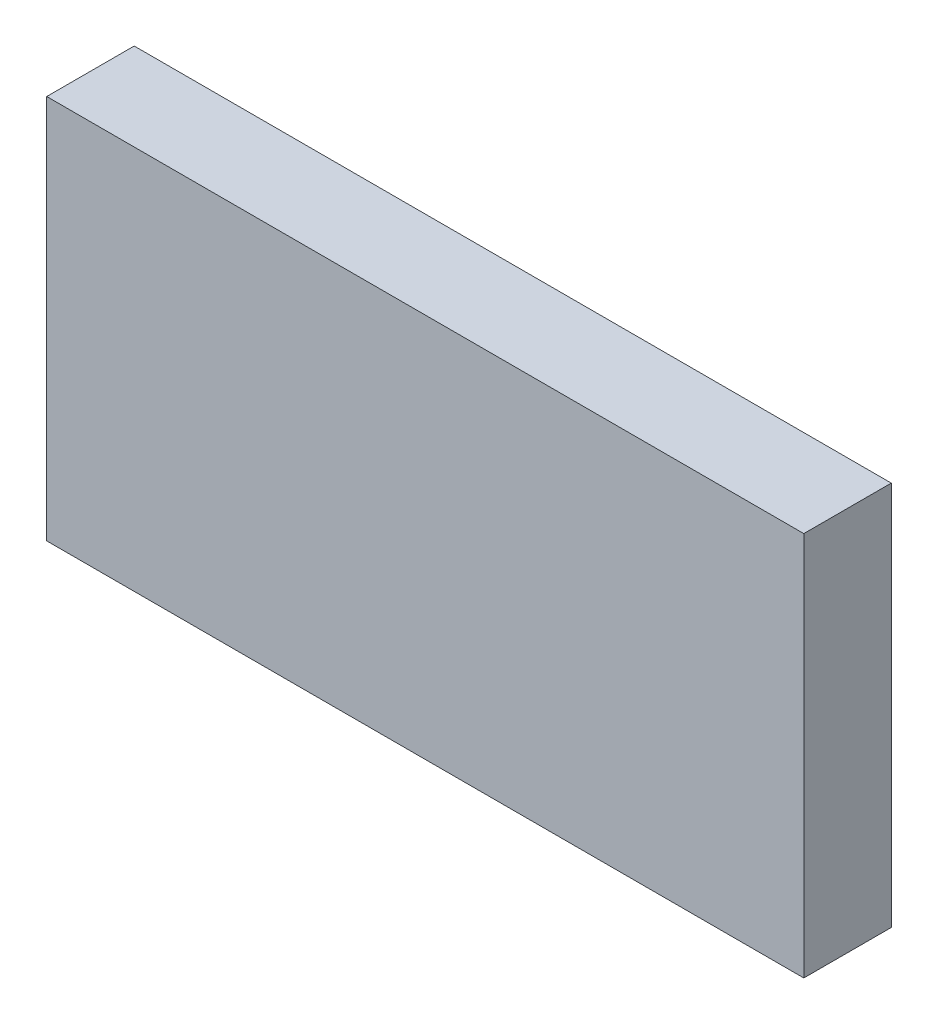
ISO-10303-21;
HEADER;
FILE_DESCRIPTION(('STEP AP214'),'2;1');
FILE_NAME('part.step','',(''),(''),'','','');
FILE_SCHEMA(('AUTOMOTIVE_DESIGN { 1 0 10303 214 1 1 1 1 }'));
ENDSEC;
DATA;
#1=APPLICATION_CONTEXT('core data for automotive mechanical design processes');
#2=APPLICATION_PROTOCOL_DEFINITION('international standard','automotive_design',2000,#1);
#3=PRODUCT_CONTEXT('',#1,'mechanical');
#4=PRODUCT('Part','Part','',(#3));
#5=PRODUCT_RELATED_PRODUCT_CATEGORY('part','',(#4));
#6=PRODUCT_DEFINITION_FORMATION('','',#4);
#7=PRODUCT_DEFINITION_CONTEXT('part definition',#1,'design');
#8=PRODUCT_DEFINITION('design','',#6,#7);
#9=PRODUCT_DEFINITION_SHAPE('','',#8);
#10=(LENGTH_UNIT() NAMED_UNIT(*) SI_UNIT(.MILLI.,.METRE.));
#11=(NAMED_UNIT(*) PLANE_ANGLE_UNIT() SI_UNIT($,.RADIAN.));
#12=(NAMED_UNIT(*) SI_UNIT($,.STERADIAN.) SOLID_ANGLE_UNIT());
#13=UNCERTAINTY_MEASURE_WITH_UNIT(LENGTH_MEASURE(1.E-05),#10,'distance_accuracy_value','');
#14=(GEOMETRIC_REPRESENTATION_CONTEXT(3) GLOBAL_UNCERTAINTY_ASSIGNED_CONTEXT((#13)) GLOBAL_UNIT_ASSIGNED_CONTEXT((#10,
#11,#12)) REPRESENTATION_CONTEXT('',''));
#15=CARTESIAN_POINT('',(0.,0.,0.));
#16=DIRECTION('',(0.,0.,1.));
#17=DIRECTION('',(1.,0.,0.));
#18=AXIS2_PLACEMENT_3D('',#15,#16,#17);
#19=CARTESIAN_POINT('',(0.5795,-2.22,0.));
#20=DIRECTION('',(1.,0.,0.));
#21=DIRECTION('',(0.,0.,1.));
#22=AXIS2_PLACEMENT_3D('',#19,#20,#21);
#23=PLANE('',#22);
#24=DIRECTION('',(0.,1.,0.));
#25=VECTOR('',#24,1.);
#26=CARTESIAN_POINT('',(0.5795,-2.22,0.1));
#27=LINE('',#26,#25);
#28=CARTESIAN_POINT('',(0.5795,-2.22,0.1));
#29=VERTEX_POINT('',#28);
#30=CARTESIAN_POINT('',(0.5795,-1.78,0.1));
#31=VERTEX_POINT('',#30);
#32=EDGE_CURVE('E11',#29,#31,#27,.T.);
#33=ORIENTED_EDGE('',*,*,#32,.T.);
#34=DIRECTION('',(0.,0.,1.));
#35=VECTOR('',#34,1.);
#36=CARTESIAN_POINT('',(0.5795,-1.78,0.));
#37=LINE('',#36,#35);
#38=CARTESIAN_POINT('',(0.5795,-1.78,0.));
#39=VERTEX_POINT('',#38);
#40=EDGE_CURVE('E24',#39,#31,#37,.T.);
#41=ORIENTED_EDGE('',*,*,#40,.F.);
#42=DIRECTION('',(0.,1.,0.));
#43=VECTOR('',#42,1.);
#44=CARTESIAN_POINT('',(0.5795,-2.22,0.));
#45=LINE('',#44,#43);
#46=CARTESIAN_POINT('',(0.5795,-2.22,0.));
#47=VERTEX_POINT('',#46);
#48=EDGE_CURVE('E86',#47,#39,#45,.T.);
#49=ORIENTED_EDGE('',*,*,#48,.F.);
#50=DIRECTION('',(0.,0.,1.));
#51=VECTOR('',#50,1.);
#52=CARTESIAN_POINT('',(0.5795,-2.22,0.));
#53=LINE('',#52,#51);
#54=EDGE_CURVE('E36',#47,#29,#53,.T.);
#55=ORIENTED_EDGE('',*,*,#54,.T.);
#56=EDGE_LOOP('',(#33,#41,#49,#55));
#57=FACE_BOUND('',#56,.T.);
#58=ADVANCED_FACE('F17',(#57),#23,.F.);
#59=CARTESIAN_POINT('',(1.445,-2.22,0.));
#60=DIRECTION('',(1.,0.,0.));
#61=DIRECTION('',(0.,0.,1.));
#62=AXIS2_PLACEMENT_3D('',#59,#60,#61);
#63=PLANE('',#62);
#64=DIRECTION('',(0.,0.,1.));
#65=VECTOR('',#64,1.);
#66=CARTESIAN_POINT('',(1.445,-2.22,0.));
#67=LINE('',#66,#65);
#68=CARTESIAN_POINT('',(1.445,-2.22,0.));
#69=VERTEX_POINT('',#68);
#70=CARTESIAN_POINT('',(1.445,-2.22,0.1));
#71=VERTEX_POINT('',#70);
#72=EDGE_CURVE('E83',#69,#71,#67,.T.);
#73=ORIENTED_EDGE('',*,*,#72,.F.);
#74=DIRECTION('',(0.,1.,0.));
#75=VECTOR('',#74,1.);
#76=CARTESIAN_POINT('',(1.445,-2.22,0.));
#77=LINE('',#76,#75);
#78=CARTESIAN_POINT('',(1.445,-1.78,0.));
#79=VERTEX_POINT('',#78);
#80=EDGE_CURVE('E63',#69,#79,#77,.T.);
#81=ORIENTED_EDGE('',*,*,#80,.T.);
#82=DIRECTION('',(0.,0.,1.));
#83=VECTOR('',#82,1.);
#84=CARTESIAN_POINT('',(1.445,-1.78,0.));
#85=LINE('',#84,#83);
#86=CARTESIAN_POINT('',(1.445,-1.78,0.1));
#87=VERTEX_POINT('',#86);
#88=EDGE_CURVE('E57',#79,#87,#85,.T.);
#89=ORIENTED_EDGE('',*,*,#88,.T.);
#90=DIRECTION('',(0.,1.,0.));
#91=VECTOR('',#90,1.);
#92=CARTESIAN_POINT('',(1.445,-2.22,0.1));
#93=LINE('',#92,#91);
#94=EDGE_CURVE('E60',#71,#87,#93,.T.);
#95=ORIENTED_EDGE('',*,*,#94,.F.);
#96=EDGE_LOOP('',(#73,#81,#89,#95));
#97=FACE_BOUND('',#96,.T.);
#98=ADVANCED_FACE('F59',(#97),#63,.T.);
#99=CARTESIAN_POINT('',(0.5795,-2.22,0.));
#100=DIRECTION('',(0.,1.,0.));
#101=DIRECTION('',(0.,0.,1.));
#102=AXIS2_PLACEMENT_3D('',#99,#100,#101);
#103=PLANE('',#102);
#104=ORIENTED_EDGE('',*,*,#72,.T.);
#105=DIRECTION('',(1.,0.,0.));
#106=VECTOR('',#105,1.);
#107=CARTESIAN_POINT('',(0.5795,-2.22,0.1));
#108=LINE('',#107,#106);
#109=EDGE_CURVE('E71',#29,#71,#108,.T.);
#110=ORIENTED_EDGE('',*,*,#109,.F.);
#111=ORIENTED_EDGE('',*,*,#54,.F.);
#112=DIRECTION('',(1.,0.,0.));
#113=VECTOR('',#112,1.);
#114=CARTESIAN_POINT('',(0.5795,-2.22,0.));
#115=LINE('',#114,#113);
#116=EDGE_CURVE('E76',#47,#69,#115,.T.);
#117=ORIENTED_EDGE('',*,*,#116,.T.);
#118=EDGE_LOOP('',(#104,#110,#111,#117));
#119=FACE_BOUND('',#118,.T.);
#120=ADVANCED_FACE('F91',(#119),#103,.F.);
#121=CARTESIAN_POINT('',(0.5795,-1.78,0.));
#122=DIRECTION('',(0.,1.,0.));
#123=DIRECTION('',(0.,0.,1.));
#124=AXIS2_PLACEMENT_3D('',#121,#122,#123);
#125=PLANE('',#124);
#126=DIRECTION('',(1.,0.,0.));
#127=VECTOR('',#126,1.);
#128=CARTESIAN_POINT('',(0.5795,-1.78,0.));
#129=LINE('',#128,#127);
#130=EDGE_CURVE('E74',#39,#79,#129,.T.);
#131=ORIENTED_EDGE('',*,*,#130,.F.);
#132=ORIENTED_EDGE('',*,*,#40,.T.);
#133=DIRECTION('',(1.,0.,0.));
#134=VECTOR('',#133,1.);
#135=CARTESIAN_POINT('',(0.5795,-1.78,0.1));
#136=LINE('',#135,#134);
#137=EDGE_CURVE('E69',#31,#87,#136,.T.);
#138=ORIENTED_EDGE('',*,*,#137,.T.);
#139=ORIENTED_EDGE('',*,*,#88,.F.);
#140=EDGE_LOOP('',(#131,#132,#138,#139));
#141=FACE_BOUND('',#140,.T.);
#142=ADVANCED_FACE('F73',(#141),#125,.T.);
#143=CARTESIAN_POINT('',(0.5795,-2.22,0.));
#144=DIRECTION('',(0.,0.,1.));
#145=DIRECTION('',(1.,0.,0.));
#146=AXIS2_PLACEMENT_3D('',#143,#144,#145);
#147=PLANE('',#146);
#148=ORIENTED_EDGE('',*,*,#130,.T.);
#149=ORIENTED_EDGE('',*,*,#80,.F.);
#150=ORIENTED_EDGE('',*,*,#116,.F.);
#151=ORIENTED_EDGE('',*,*,#48,.T.);
#152=EDGE_LOOP('',(#148,#149,#150,#151));
#153=FACE_BOUND('',#152,.T.);
#154=ADVANCED_FACE('F89',(#153),#147,.F.);
#155=CARTESIAN_POINT('',(0.5795,-2.22,0.1));
#156=DIRECTION('',(0.,0.,1.));
#157=DIRECTION('',(1.,0.,0.));
#158=AXIS2_PLACEMENT_3D('',#155,#156,#157);
#159=PLANE('',#158);
#160=ORIENTED_EDGE('',*,*,#32,.F.);
#161=ORIENTED_EDGE('',*,*,#109,.T.);
#162=ORIENTED_EDGE('',*,*,#94,.T.);
#163=ORIENTED_EDGE('',*,*,#137,.F.);
#164=EDGE_LOOP('',(#160,#161,#162,#163));
#165=FACE_BOUND('',#164,.T.);
#166=ADVANCED_FACE('F68',(#165),#159,.T.);
#167=CLOSED_SHELL('',(#58,#98,#120,#142,#154,#166));
#168=MANIFOLD_SOLID_BREP('B1',#167);
#169=ADVANCED_BREP_SHAPE_REPRESENTATION('',(#18,#168),#14);
#170=SHAPE_DEFINITION_REPRESENTATION(#9,#169);
ENDSEC;
END-ISO-10303-21;
